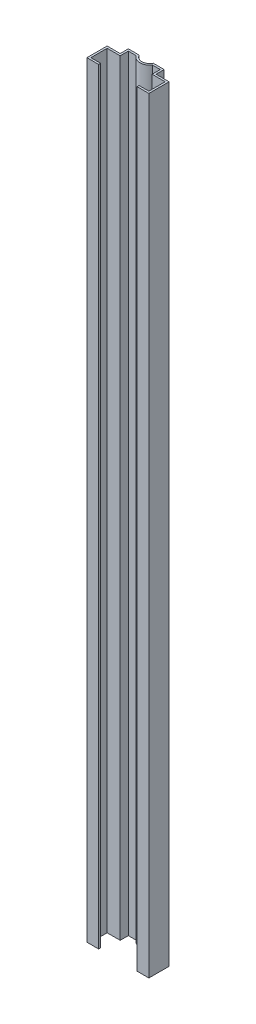
ISO-10303-21;
HEADER;
FILE_DESCRIPTION(('STEP AP214'),'2;1');
FILE_NAME('part.step','',(''),(''),'','','');
FILE_SCHEMA(('AUTOMOTIVE_DESIGN { 1 0 10303 214 1 1 1 1 }'));
ENDSEC;
DATA;
#1=APPLICATION_CONTEXT('core data for automotive mechanical design processes');
#2=APPLICATION_PROTOCOL_DEFINITION('international standard','automotive_design',2000,#1);
#3=PRODUCT_CONTEXT('',#1,'mechanical');
#4=PRODUCT('Part','Part','',(#3));
#5=PRODUCT_RELATED_PRODUCT_CATEGORY('part','',(#4));
#6=PRODUCT_DEFINITION_FORMATION('','',#4);
#7=PRODUCT_DEFINITION_CONTEXT('part definition',#1,'design');
#8=PRODUCT_DEFINITION('design','',#6,#7);
#9=PRODUCT_DEFINITION_SHAPE('','',#8);
#10=(LENGTH_UNIT() NAMED_UNIT(*) SI_UNIT(.MILLI.,.METRE.));
#11=(NAMED_UNIT(*) PLANE_ANGLE_UNIT() SI_UNIT($,.RADIAN.));
#12=(NAMED_UNIT(*) SI_UNIT($,.STERADIAN.) SOLID_ANGLE_UNIT());
#13=UNCERTAINTY_MEASURE_WITH_UNIT(LENGTH_MEASURE(1.E-05),#10,'distance_accuracy_value','');
#14=(GEOMETRIC_REPRESENTATION_CONTEXT(3) GLOBAL_UNCERTAINTY_ASSIGNED_CONTEXT((#13)) GLOBAL_UNIT_ASSIGNED_CONTEXT((#10,
#11,#12)) REPRESENTATION_CONTEXT('',''));
#15=CARTESIAN_POINT('',(0.,0.,0.));
#16=DIRECTION('',(0.,0.,1.));
#17=DIRECTION('',(1.,0.,0.));
#18=AXIS2_PLACEMENT_3D('',#15,#16,#17);
#19=CARTESIAN_POINT('',(0.,4.44089209850063E-13,-91.583123951777));
#20=DIRECTION('',(0.,1.,0.));
#21=DIRECTION('',(0.,0.,1.));
#22=AXIS2_PLACEMENT_3D('',#19,#20,#21);
#23=CYLINDRICAL_SURFACE('',#22,30.);
#24=CARTESIAN_POINT('',(0.,2350.,-91.583123951777));
#25=DIRECTION('',(0.,1.,0.));
#26=DIRECTION('',(0.,0.,1.));
#27=AXIS2_PLACEMENT_3D('',#24,#25,#26);
#28=CIRCLE('',#27,30.);
#29=CARTESIAN_POINT('',(-25.,2350.,-75.));
#30=VERTEX_POINT('',#29);
#31=CARTESIAN_POINT('',(25.,2350.,-75.));
#32=VERTEX_POINT('',#31);
#33=EDGE_CURVE('E226',#30,#32,#28,.T.);
#34=ORIENTED_EDGE('',*,*,#33,.F.);
#35=DIRECTION('',(0.,1.,0.));
#36=VECTOR('',#35,1.);
#37=CARTESIAN_POINT('',(-25.,4.44089209850063E-13,-75.));
#38=LINE('',#37,#36);
#39=CARTESIAN_POINT('',(-25.,4.44089209850063E-13,-75.));
#40=VERTEX_POINT('',#39);
#41=EDGE_CURVE('E11',#40,#30,#38,.T.);
#42=ORIENTED_EDGE('',*,*,#41,.F.);
#43=CARTESIAN_POINT('',(0.,4.44089209850063E-13,-91.583123951777));
#44=DIRECTION('',(0.,1.,0.));
#45=DIRECTION('',(0.,0.,1.));
#46=AXIS2_PLACEMENT_3D('',#43,#44,#45);
#47=CIRCLE('',#46,30.);
#48=CARTESIAN_POINT('',(25.,4.44089209850063E-13,-75.));
#49=VERTEX_POINT('',#48);
#50=EDGE_CURVE('E294',#40,#49,#47,.T.);
#51=ORIENTED_EDGE('',*,*,#50,.T.);
#52=DIRECTION('',(0.,1.,0.));
#53=VECTOR('',#52,1.);
#54=CARTESIAN_POINT('',(25.,4.44089209850063E-13,-75.));
#55=LINE('',#54,#53);
#56=EDGE_CURVE('E36',#49,#32,#55,.T.);
#57=ORIENTED_EDGE('',*,*,#56,.T.);
#58=EDGE_LOOP('',(#34,#42,#51,#57));
#59=FACE_BOUND('',#58,.T.);
#60=ADVANCED_FACE('F33',(#59),#23,.T.);
#61=CARTESIAN_POINT('',(-49.,4.44089209850063E-13,-75.));
#62=DIRECTION('',(0.,0.,1.));
#63=DIRECTION('',(1.,0.,0.));
#64=AXIS2_PLACEMENT_3D('',#61,#62,#63);
#65=PLANE('',#64);
#66=DIRECTION('',(1.,0.,0.));
#67=VECTOR('',#66,1.);
#68=CARTESIAN_POINT('',(-49.,2350.,-75.));
#69=LINE('',#68,#67);
#70=CARTESIAN_POINT('',(-49.,2350.,-75.));
#71=VERTEX_POINT('',#70);
#72=EDGE_CURVE('E292',#71,#30,#69,.T.);
#73=ORIENTED_EDGE('',*,*,#72,.F.);
#74=DIRECTION('',(0.,1.,0.));
#75=VECTOR('',#74,1.);
#76=CARTESIAN_POINT('',(-49.,4.44089209850063E-13,-75.));
#77=LINE('',#76,#75);
#78=CARTESIAN_POINT('',(-49.,4.44089209850063E-13,-75.));
#79=VERTEX_POINT('',#78);
#80=EDGE_CURVE('E42',#79,#71,#77,.T.);
#81=ORIENTED_EDGE('',*,*,#80,.F.);
#82=DIRECTION('',(1.,0.,0.));
#83=VECTOR('',#82,1.);
#84=CARTESIAN_POINT('',(-49.,4.44089209850063E-13,-75.));
#85=LINE('',#84,#83);
#86=EDGE_CURVE('E216',#79,#40,#85,.T.);
#87=ORIENTED_EDGE('',*,*,#86,.T.);
#88=ORIENTED_EDGE('',*,*,#41,.T.);
#89=EDGE_LOOP('',(#73,#81,#87,#88));
#90=FACE_BOUND('',#89,.T.);
#91=ADVANCED_FACE('F338',(#90),#65,.T.);
#92=CARTESIAN_POINT('',(-49.,4.44089209850063E-13,-50.));
#93=DIRECTION('',(1.,0.,0.));
#94=DIRECTION('',(0.,0.,-1.));
#95=AXIS2_PLACEMENT_3D('',#92,#93,#94);
#96=PLANE('',#95);
#97=DIRECTION('',(0.,0.,-1.));
#98=VECTOR('',#97,1.);
#99=CARTESIAN_POINT('',(-49.,2350.,-50.));
#100=LINE('',#99,#98);
#101=CARTESIAN_POINT('',(-49.,2350.,-50.));
#102=VERTEX_POINT('',#101);
#103=EDGE_CURVE('E203',#102,#71,#100,.T.);
#104=ORIENTED_EDGE('',*,*,#103,.F.);
#105=DIRECTION('',(0.,1.,0.));
#106=VECTOR('',#105,1.);
#107=CARTESIAN_POINT('',(-49.,4.44089209850063E-13,-50.));
#108=LINE('',#107,#106);
#109=CARTESIAN_POINT('',(-49.,4.44089209850063E-13,-50.));
#110=VERTEX_POINT('',#109);
#111=EDGE_CURVE('E198',#110,#102,#108,.T.);
#112=ORIENTED_EDGE('',*,*,#111,.F.);
#113=DIRECTION('',(0.,0.,-1.));
#114=VECTOR('',#113,1.);
#115=CARTESIAN_POINT('',(-49.,4.44089209850063E-13,-50.));
#116=LINE('',#115,#114);
#117=EDGE_CURVE('E201',#110,#79,#116,.T.);
#118=ORIENTED_EDGE('',*,*,#117,.T.);
#119=ORIENTED_EDGE('',*,*,#80,.T.);
#120=EDGE_LOOP('',(#104,#112,#118,#119));
#121=FACE_BOUND('',#120,.T.);
#122=ADVANCED_FACE('F200',(#121),#96,.T.);
#123=CARTESIAN_POINT('',(-89.,4.44089209850063E-13,-50.));
#124=DIRECTION('',(0.,0.,1.));
#125=DIRECTION('',(1.,0.,0.));
#126=AXIS2_PLACEMENT_3D('',#123,#124,#125);
#127=PLANE('',#126);
#128=DIRECTION('',(1.,0.,0.));
#129=VECTOR('',#128,1.);
#130=CARTESIAN_POINT('',(-89.,2350.,-50.));
#131=LINE('',#130,#129);
#132=CARTESIAN_POINT('',(-89.,2350.,-50.));
#133=VERTEX_POINT('',#132);
#134=EDGE_CURVE('E289',#133,#102,#131,.T.);
#135=ORIENTED_EDGE('',*,*,#134,.F.);
#136=DIRECTION('',(0.,1.,0.));
#137=VECTOR('',#136,1.);
#138=CARTESIAN_POINT('',(-89.,4.44089209850063E-13,-50.));
#139=LINE('',#138,#137);
#140=CARTESIAN_POINT('',(-89.,4.44089209850063E-13,-50.));
#141=VERTEX_POINT('',#140);
#142=EDGE_CURVE('E208',#141,#133,#139,.T.);
#143=ORIENTED_EDGE('',*,*,#142,.F.);
#144=DIRECTION('',(1.,0.,0.));
#145=VECTOR('',#144,1.);
#146=CARTESIAN_POINT('',(-89.,4.44089209850063E-13,-50.));
#147=LINE('',#146,#145);
#148=EDGE_CURVE('E214',#141,#110,#147,.T.);
#149=ORIENTED_EDGE('',*,*,#148,.T.);
#150=ORIENTED_EDGE('',*,*,#111,.T.);
#151=EDGE_LOOP('',(#135,#143,#149,#150));
#152=FACE_BOUND('',#151,.T.);
#153=ADVANCED_FACE('F218',(#152),#127,.T.);
#154=CARTESIAN_POINT('',(-89.,4.44089209850063E-13,0.));
#155=DIRECTION('',(1.,0.,0.));
#156=DIRECTION('',(0.,0.,-1.));
#157=AXIS2_PLACEMENT_3D('',#154,#155,#156);
#158=PLANE('',#157);
#159=DIRECTION('',(0.,0.,-1.));
#160=VECTOR('',#159,1.);
#161=CARTESIAN_POINT('',(-89.,2350.,0.));
#162=LINE('',#161,#160);
#163=CARTESIAN_POINT('',(-89.,2350.,0.));
#164=VERTEX_POINT('',#163);
#165=EDGE_CURVE('E286',#164,#133,#162,.T.);
#166=ORIENTED_EDGE('',*,*,#165,.F.);
#167=DIRECTION('',(0.,1.,0.));
#168=VECTOR('',#167,1.);
#169=CARTESIAN_POINT('',(-89.,4.44089209850063E-13,0.));
#170=LINE('',#169,#168);
#171=CARTESIAN_POINT('',(-89.,4.44089209850063E-13,0.));
#172=VERTEX_POINT('',#171);
#173=EDGE_CURVE('E298',#172,#164,#170,.T.);
#174=ORIENTED_EDGE('',*,*,#173,.F.);
#175=DIRECTION('',(0.,0.,-1.));
#176=VECTOR('',#175,1.);
#177=CARTESIAN_POINT('',(-89.,4.44089209850063E-13,0.));
#178=LINE('',#177,#176);
#179=EDGE_CURVE('E219',#172,#141,#178,.T.);
#180=ORIENTED_EDGE('',*,*,#179,.T.);
#181=ORIENTED_EDGE('',*,*,#142,.T.);
#182=EDGE_LOOP('',(#166,#174,#180,#181));
#183=FACE_BOUND('',#182,.T.);
#184=ADVANCED_FACE('F351',(#183),#158,.T.);
#185=CARTESIAN_POINT('',(-59.,4.44089209850063E-13,0.));
#186=DIRECTION('',(0.,0.,-1.));
#187=DIRECTION('',(-1.,0.,0.));
#188=AXIS2_PLACEMENT_3D('',#185,#186,#187);
#189=PLANE('',#188);
#190=DIRECTION('',(-1.,0.,0.));
#191=VECTOR('',#190,1.);
#192=CARTESIAN_POINT('',(-59.,2350.,0.));
#193=LINE('',#192,#191);
#194=CARTESIAN_POINT('',(-59.,2350.,0.));
#195=VERTEX_POINT('',#194);
#196=EDGE_CURVE('E283',#195,#164,#193,.T.);
#197=ORIENTED_EDGE('',*,*,#196,.F.);
#198=DIRECTION('',(0.,1.,0.));
#199=VECTOR('',#198,1.);
#200=CARTESIAN_POINT('',(-59.,4.44089209850063E-13,0.));
#201=LINE('',#200,#199);
#202=CARTESIAN_POINT('',(-59.,4.44089209850063E-13,0.));
#203=VERTEX_POINT('',#202);
#204=EDGE_CURVE('E300',#203,#195,#201,.T.);
#205=ORIENTED_EDGE('',*,*,#204,.F.);
#206=DIRECTION('',(-1.,0.,0.));
#207=VECTOR('',#206,1.);
#208=CARTESIAN_POINT('',(-59.,4.44089209850063E-13,0.));
#209=LINE('',#208,#207);
#210=EDGE_CURVE('E221',#203,#172,#209,.T.);
#211=ORIENTED_EDGE('',*,*,#210,.T.);
#212=ORIENTED_EDGE('',*,*,#173,.T.);
#213=EDGE_LOOP('',(#197,#205,#211,#212));
#214=FACE_BOUND('',#213,.T.);
#215=ADVANCED_FACE('F354',(#214),#189,.T.);
#216=CARTESIAN_POINT('',(-59.,4.44089209850063E-13,6.));
#217=DIRECTION('',(1.,0.,0.));
#218=DIRECTION('',(0.,0.,-1.));
#219=AXIS2_PLACEMENT_3D('',#216,#217,#218);
#220=PLANE('',#219);
#221=DIRECTION('',(0.,0.,-1.));
#222=VECTOR('',#221,1.);
#223=CARTESIAN_POINT('',(-59.,2350.,6.));
#224=LINE('',#223,#222);
#225=CARTESIAN_POINT('',(-59.,2350.,6.));
#226=VERTEX_POINT('',#225);
#227=EDGE_CURVE('E280',#226,#195,#224,.T.);
#228=ORIENTED_EDGE('',*,*,#227,.F.);
#229=DIRECTION('',(0.,1.,0.));
#230=VECTOR('',#229,1.);
#231=CARTESIAN_POINT('',(-59.,4.44089209850063E-13,6.));
#232=LINE('',#231,#230);
#233=CARTESIAN_POINT('',(-59.,4.44089209850063E-13,6.));
#234=VERTEX_POINT('',#233);
#235=EDGE_CURVE('E302',#234,#226,#232,.T.);
#236=ORIENTED_EDGE('',*,*,#235,.F.);
#237=DIRECTION('',(0.,0.,-1.));
#238=VECTOR('',#237,1.);
#239=CARTESIAN_POINT('',(-59.,4.44089209850063E-13,6.));
#240=LINE('',#239,#238);
#241=EDGE_CURVE('E644',#234,#203,#240,.T.);
#242=ORIENTED_EDGE('',*,*,#241,.T.);
#243=ORIENTED_EDGE('',*,*,#204,.T.);
#244=EDGE_LOOP('',(#228,#236,#242,#243));
#245=FACE_BOUND('',#244,.T.);
#246=ADVANCED_FACE('F358',(#245),#220,.T.);
#247=CARTESIAN_POINT('',(-95.,4.44089209850063E-13,6.));
#248=DIRECTION('',(0.,0.,1.));
#249=DIRECTION('',(1.,0.,0.));
#250=AXIS2_PLACEMENT_3D('',#247,#248,#249);
#251=PLANE('',#250);
#252=DIRECTION('',(1.,0.,0.));
#253=VECTOR('',#252,1.);
#254=CARTESIAN_POINT('',(-95.,2350.,6.));
#255=LINE('',#254,#253);
#256=CARTESIAN_POINT('',(-95.,2350.,6.));
#257=VERTEX_POINT('',#256);
#258=EDGE_CURVE('E277',#257,#226,#255,.T.);
#259=ORIENTED_EDGE('',*,*,#258,.F.);
#260=DIRECTION('',(0.,1.,0.));
#261=VECTOR('',#260,1.);
#262=CARTESIAN_POINT('',(-95.,4.44089209850063E-13,6.));
#263=LINE('',#262,#261);
#264=CARTESIAN_POINT('',(-95.,4.44089209850063E-13,6.));
#265=VERTEX_POINT('',#264);
#266=EDGE_CURVE('E304',#265,#257,#263,.T.);
#267=ORIENTED_EDGE('',*,*,#266,.F.);
#268=DIRECTION('',(1.,0.,0.));
#269=VECTOR('',#268,1.);
#270=CARTESIAN_POINT('',(-95.,4.44089209850063E-13,6.));
#271=LINE('',#270,#269);
#272=EDGE_CURVE('E648',#265,#234,#271,.T.);
#273=ORIENTED_EDGE('',*,*,#272,.T.);
#274=ORIENTED_EDGE('',*,*,#235,.T.);
#275=EDGE_LOOP('',(#259,#267,#273,#274));
#276=FACE_BOUND('',#275,.T.);
#277=ADVANCED_FACE('F362',(#276),#251,.T.);
#278=CARTESIAN_POINT('',(-95.,4.44089209850063E-13,-56.));
#279=DIRECTION('',(-1.,0.,0.));
#280=DIRECTION('',(0.,0.,1.));
#281=AXIS2_PLACEMENT_3D('',#278,#279,#280);
#282=PLANE('',#281);
#283=DIRECTION('',(0.,0.,1.));
#284=VECTOR('',#283,1.);
#285=CARTESIAN_POINT('',(-95.,2350.,-56.));
#286=LINE('',#285,#284);
#287=CARTESIAN_POINT('',(-95.,2350.,-56.));
#288=VERTEX_POINT('',#287);
#289=EDGE_CURVE('E274',#288,#257,#286,.T.);
#290=ORIENTED_EDGE('',*,*,#289,.F.);
#291=DIRECTION('',(0.,1.,0.));
#292=VECTOR('',#291,1.);
#293=CARTESIAN_POINT('',(-95.,4.44089209850063E-13,-56.));
#294=LINE('',#293,#292);
#295=CARTESIAN_POINT('',(-95.,4.44089209850063E-13,-56.));
#296=VERTEX_POINT('',#295);
#297=EDGE_CURVE('E306',#296,#288,#294,.T.);
#298=ORIENTED_EDGE('',*,*,#297,.F.);
#299=DIRECTION('',(0.,0.,1.));
#300=VECTOR('',#299,1.);
#301=CARTESIAN_POINT('',(-95.,4.44089209850063E-13,-56.));
#302=LINE('',#301,#300);
#303=EDGE_CURVE('E637',#296,#265,#302,.T.);
#304=ORIENTED_EDGE('',*,*,#303,.T.);
#305=ORIENTED_EDGE('',*,*,#266,.T.);
#306=EDGE_LOOP('',(#290,#298,#304,#305));
#307=FACE_BOUND('',#306,.T.);
#308=ADVANCED_FACE('F366',(#307),#282,.T.);
#309=CARTESIAN_POINT('',(-55.,4.44089209850063E-13,-56.));
#310=DIRECTION('',(0.,0.,-1.));
#311=DIRECTION('',(-1.,0.,0.));
#312=AXIS2_PLACEMENT_3D('',#309,#310,#311);
#313=PLANE('',#312);
#314=DIRECTION('',(-1.,0.,0.));
#315=VECTOR('',#314,1.);
#316=CARTESIAN_POINT('',(-55.,2350.,-56.));
#317=LINE('',#316,#315);
#318=CARTESIAN_POINT('',(-55.,2350.,-56.));
#319=VERTEX_POINT('',#318);
#320=EDGE_CURVE('E271',#319,#288,#317,.T.);
#321=ORIENTED_EDGE('',*,*,#320,.F.);
#322=DIRECTION('',(0.,1.,0.));
#323=VECTOR('',#322,1.);
#324=CARTESIAN_POINT('',(-55.,4.44089209850063E-13,-56.));
#325=LINE('',#324,#323);
#326=CARTESIAN_POINT('',(-55.,4.44089209850063E-13,-56.));
#327=VERTEX_POINT('',#326);
#328=EDGE_CURVE('E308',#327,#319,#325,.T.);
#329=ORIENTED_EDGE('',*,*,#328,.F.);
#330=DIRECTION('',(-1.,0.,0.));
#331=VECTOR('',#330,1.);
#332=CARTESIAN_POINT('',(-55.,4.44089209850063E-13,-56.));
#333=LINE('',#332,#331);
#334=EDGE_CURVE('E633',#327,#296,#333,.T.);
#335=ORIENTED_EDGE('',*,*,#334,.T.);
#336=ORIENTED_EDGE('',*,*,#297,.T.);
#337=EDGE_LOOP('',(#321,#329,#335,#336));
#338=FACE_BOUND('',#337,.T.);
#339=ADVANCED_FACE('F370',(#338),#313,.T.);
#340=CARTESIAN_POINT('',(-55.,4.44089209850063E-13,-81.));
#341=DIRECTION('',(-1.,0.,0.));
#342=DIRECTION('',(0.,0.,1.));
#343=AXIS2_PLACEMENT_3D('',#340,#341,#342);
#344=PLANE('',#343);
#345=DIRECTION('',(0.,0.,1.));
#346=VECTOR('',#345,1.);
#347=CARTESIAN_POINT('',(-55.,2350.,-81.));
#348=LINE('',#347,#346);
#349=CARTESIAN_POINT('',(-55.,2350.,-81.));
#350=VERTEX_POINT('',#349);
#351=EDGE_CURVE('E268',#350,#319,#348,.T.);
#352=ORIENTED_EDGE('',*,*,#351,.F.);
#353=DIRECTION('',(0.,1.,0.));
#354=VECTOR('',#353,1.);
#355=CARTESIAN_POINT('',(-55.,4.44089209850063E-13,-81.));
#356=LINE('',#355,#354);
#357=CARTESIAN_POINT('',(-55.,4.44089209850063E-13,-81.));
#358=VERTEX_POINT('',#357);
#359=EDGE_CURVE('E310',#358,#350,#356,.T.);
#360=ORIENTED_EDGE('',*,*,#359,.F.);
#361=DIRECTION('',(0.,0.,1.));
#362=VECTOR('',#361,1.);
#363=CARTESIAN_POINT('',(-55.,4.44089209850063E-13,-81.));
#364=LINE('',#363,#362);
#365=EDGE_CURVE('E654',#358,#327,#364,.T.);
#366=ORIENTED_EDGE('',*,*,#365,.T.);
#367=ORIENTED_EDGE('',*,*,#328,.T.);
#368=EDGE_LOOP('',(#352,#360,#366,#367));
#369=FACE_BOUND('',#368,.T.);
#370=ADVANCED_FACE('F374',(#369),#344,.T.);
#371=CARTESIAN_POINT('',(-21.5406009066907,4.44089209850063E-13,-81.));
#372=DIRECTION('',(0.,0.,-1.));
#373=DIRECTION('',(-1.,0.,0.));
#374=AXIS2_PLACEMENT_3D('',#371,#372,#373);
#375=PLANE('',#374);
#376=DIRECTION('',(-1.,0.,0.));
#377=VECTOR('',#376,1.);
#378=CARTESIAN_POINT('',(-21.5406009066907,2350.,-81.));
#379=LINE('',#378,#377);
#380=CARTESIAN_POINT('',(-21.5406009066907,2350.,-81.));
#381=VERTEX_POINT('',#380);
#382=EDGE_CURVE('E265',#381,#350,#379,.T.);
#383=ORIENTED_EDGE('',*,*,#382,.F.);
#384=DIRECTION('',(0.,1.,0.));
#385=VECTOR('',#384,1.);
#386=CARTESIAN_POINT('',(-21.5406009066907,4.44089209850063E-13,-81.));
#387=LINE('',#386,#385);
#388=CARTESIAN_POINT('',(-21.5406009066907,4.44089209850063E-13,-81.));
#389=VERTEX_POINT('',#388);
#390=EDGE_CURVE('E312',#389,#381,#387,.T.);
#391=ORIENTED_EDGE('',*,*,#390,.F.);
#392=DIRECTION('',(-1.,0.,0.));
#393=VECTOR('',#392,1.);
#394=CARTESIAN_POINT('',(-21.5406009066907,4.44089209850063E-13,-81.));
#395=LINE('',#394,#393);
#396=EDGE_CURVE('E626',#389,#358,#395,.T.);
#397=ORIENTED_EDGE('',*,*,#396,.T.);
#398=ORIENTED_EDGE('',*,*,#359,.T.);
#399=EDGE_LOOP('',(#383,#391,#397,#398));
#400=FACE_BOUND('',#399,.T.);
#401=ADVANCED_FACE('F378',(#400),#375,.T.);
#402=CARTESIAN_POINT('',(0.,4.44089209850063E-13,-91.583123951777));
#403=DIRECTION('',(0.,1.,0.));
#404=DIRECTION('',(0.,0.,1.));
#405=AXIS2_PLACEMENT_3D('',#402,#403,#404);
#406=CYLINDRICAL_SURFACE('',#405,24.);
#407=CARTESIAN_POINT('',(0.,2350.,-91.583123951777));
#408=DIRECTION('',(0.,-1.,0.));
#409=DIRECTION('',(0.,0.,-1.));
#410=AXIS2_PLACEMENT_3D('',#407,#408,#409);
#411=CIRCLE('',#410,24.);
#412=CARTESIAN_POINT('',(21.5406009066907,2350.,-81.));
#413=VERTEX_POINT('',#412);
#414=EDGE_CURVE('E262',#413,#381,#411,.T.);
#415=ORIENTED_EDGE('',*,*,#414,.F.);
#416=DIRECTION('',(0.,1.,0.));
#417=VECTOR('',#416,1.);
#418=CARTESIAN_POINT('',(21.5406009066907,4.44089209850063E-13,-81.));
#419=LINE('',#418,#417);
#420=CARTESIAN_POINT('',(21.5406009066907,4.44089209850063E-13,-81.));
#421=VERTEX_POINT('',#420);
#422=EDGE_CURVE('E314',#421,#413,#419,.T.);
#423=ORIENTED_EDGE('',*,*,#422,.F.);
#424=CARTESIAN_POINT('',(0.,4.44089209850063E-13,-91.583123951777));
#425=DIRECTION('',(0.,-1.,0.));
#426=DIRECTION('',(0.,0.,-1.));
#427=AXIS2_PLACEMENT_3D('',#424,#425,#426);
#428=CIRCLE('',#427,24.);
#429=EDGE_CURVE('E622',#421,#389,#428,.T.);
#430=ORIENTED_EDGE('',*,*,#429,.T.);
#431=ORIENTED_EDGE('',*,*,#390,.T.);
#432=EDGE_LOOP('',(#415,#423,#430,#431));
#433=FACE_BOUND('',#432,.T.);
#434=ADVANCED_FACE('F382',(#433),#406,.F.);
#435=CARTESIAN_POINT('',(55.,4.44089209850063E-13,-81.));
#436=DIRECTION('',(0.,0.,-1.));
#437=DIRECTION('',(-1.,0.,0.));
#438=AXIS2_PLACEMENT_3D('',#435,#436,#437);
#439=PLANE('',#438);
#440=DIRECTION('',(-1.,0.,0.));
#441=VECTOR('',#440,1.);
#442=CARTESIAN_POINT('',(55.,2350.,-81.));
#443=LINE('',#442,#441);
#444=CARTESIAN_POINT('',(55.,2350.,-81.));
#445=VERTEX_POINT('',#444);
#446=EDGE_CURVE('E259',#445,#413,#443,.T.);
#447=ORIENTED_EDGE('',*,*,#446,.F.);
#448=DIRECTION('',(0.,1.,0.));
#449=VECTOR('',#448,1.);
#450=CARTESIAN_POINT('',(55.,4.44089209850063E-13,-81.));
#451=LINE('',#450,#449);
#452=CARTESIAN_POINT('',(55.,4.44089209850063E-13,-81.));
#453=VERTEX_POINT('',#452);
#454=EDGE_CURVE('E316',#453,#445,#451,.T.);
#455=ORIENTED_EDGE('',*,*,#454,.F.);
#456=DIRECTION('',(-1.,0.,0.));
#457=VECTOR('',#456,1.);
#458=CARTESIAN_POINT('',(55.,4.44089209850063E-13,-81.));
#459=LINE('',#458,#457);
#460=EDGE_CURVE('E658',#453,#421,#459,.T.);
#461=ORIENTED_EDGE('',*,*,#460,.T.);
#462=ORIENTED_EDGE('',*,*,#422,.T.);
#463=EDGE_LOOP('',(#447,#455,#461,#462));
#464=FACE_BOUND('',#463,.T.);
#465=ADVANCED_FACE('F386',(#464),#439,.T.);
#466=CARTESIAN_POINT('',(55.,4.44089209850063E-13,-56.));
#467=DIRECTION('',(1.,0.,0.));
#468=DIRECTION('',(0.,0.,-1.));
#469=AXIS2_PLACEMENT_3D('',#466,#467,#468);
#470=PLANE('',#469);
#471=DIRECTION('',(0.,0.,-1.));
#472=VECTOR('',#471,1.);
#473=CARTESIAN_POINT('',(55.,2350.,-56.));
#474=LINE('',#473,#472);
#475=CARTESIAN_POINT('',(55.,2350.,-56.));
#476=VERTEX_POINT('',#475);
#477=EDGE_CURVE('E256',#476,#445,#474,.T.);
#478=ORIENTED_EDGE('',*,*,#477,.F.);
#479=DIRECTION('',(0.,1.,0.));
#480=VECTOR('',#479,1.);
#481=CARTESIAN_POINT('',(55.,4.44089209850063E-13,-56.));
#482=LINE('',#481,#480);
#483=CARTESIAN_POINT('',(55.,4.44089209850063E-13,-56.));
#484=VERTEX_POINT('',#483);
#485=EDGE_CURVE('E318',#484,#476,#482,.T.);
#486=ORIENTED_EDGE('',*,*,#485,.F.);
#487=DIRECTION('',(0.,0.,-1.));
#488=VECTOR('',#487,1.);
#489=CARTESIAN_POINT('',(55.,4.44089209850063E-13,-56.));
#490=LINE('',#489,#488);
#491=EDGE_CURVE('E615',#484,#453,#490,.T.);
#492=ORIENTED_EDGE('',*,*,#491,.T.);
#493=ORIENTED_EDGE('',*,*,#454,.T.);
#494=EDGE_LOOP('',(#478,#486,#492,#493));
#495=FACE_BOUND('',#494,.T.);
#496=ADVANCED_FACE('F390',(#495),#470,.T.);
#497=CARTESIAN_POINT('',(95.,4.44089209850063E-13,-56.));
#498=DIRECTION('',(0.,0.,-1.));
#499=DIRECTION('',(-1.,0.,0.));
#500=AXIS2_PLACEMENT_3D('',#497,#498,#499);
#501=PLANE('',#500);
#502=DIRECTION('',(-1.,0.,0.));
#503=VECTOR('',#502,1.);
#504=CARTESIAN_POINT('',(95.,2350.,-56.));
#505=LINE('',#504,#503);
#506=CARTESIAN_POINT('',(95.,2350.,-56.));
#507=VERTEX_POINT('',#506);
#508=EDGE_CURVE('E253',#507,#476,#505,.T.);
#509=ORIENTED_EDGE('',*,*,#508,.F.);
#510=DIRECTION('',(0.,1.,0.));
#511=VECTOR('',#510,1.);
#512=CARTESIAN_POINT('',(95.,4.44089209850063E-13,-56.));
#513=LINE('',#512,#511);
#514=CARTESIAN_POINT('',(95.,4.44089209850063E-13,-56.));
#515=VERTEX_POINT('',#514);
#516=EDGE_CURVE('E320',#515,#507,#513,.T.);
#517=ORIENTED_EDGE('',*,*,#516,.F.);
#518=DIRECTION('',(-1.,0.,0.));
#519=VECTOR('',#518,1.);
#520=CARTESIAN_POINT('',(95.,4.44089209850063E-13,-56.));
#521=LINE('',#520,#519);
#522=EDGE_CURVE('E611',#515,#484,#521,.T.);
#523=ORIENTED_EDGE('',*,*,#522,.T.);
#524=ORIENTED_EDGE('',*,*,#485,.T.);
#525=EDGE_LOOP('',(#509,#517,#523,#524));
#526=FACE_BOUND('',#525,.T.);
#527=ADVANCED_FACE('F394',(#526),#501,.T.);
#528=CARTESIAN_POINT('',(95.,4.44089209850063E-13,6.));
#529=DIRECTION('',(1.,0.,0.));
#530=DIRECTION('',(0.,0.,-1.));
#531=AXIS2_PLACEMENT_3D('',#528,#529,#530);
#532=PLANE('',#531);
#533=DIRECTION('',(0.,0.,-1.));
#534=VECTOR('',#533,1.);
#535=CARTESIAN_POINT('',(95.,2350.,6.));
#536=LINE('',#535,#534);
#537=CARTESIAN_POINT('',(95.,2350.,6.));
#538=VERTEX_POINT('',#537);
#539=EDGE_CURVE('E250',#538,#507,#536,.T.);
#540=ORIENTED_EDGE('',*,*,#539,.F.);
#541=DIRECTION('',(0.,1.,0.));
#542=VECTOR('',#541,1.);
#543=CARTESIAN_POINT('',(95.,4.44089209850063E-13,6.));
#544=LINE('',#543,#542);
#545=CARTESIAN_POINT('',(95.,4.44089209850063E-13,6.));
#546=VERTEX_POINT('',#545);
#547=EDGE_CURVE('E322',#546,#538,#544,.T.);
#548=ORIENTED_EDGE('',*,*,#547,.F.);
#549=DIRECTION('',(0.,0.,-1.));
#550=VECTOR('',#549,1.);
#551=CARTESIAN_POINT('',(95.,4.44089209850063E-13,6.));
#552=LINE('',#551,#550);
#553=EDGE_CURVE('E662',#546,#515,#552,.T.);
#554=ORIENTED_EDGE('',*,*,#553,.T.);
#555=ORIENTED_EDGE('',*,*,#516,.T.);
#556=EDGE_LOOP('',(#540,#548,#554,#555));
#557=FACE_BOUND('',#556,.T.);
#558=ADVANCED_FACE('F398',(#557),#532,.T.);
#559=CARTESIAN_POINT('',(59.,4.44089209850063E-13,6.));
#560=DIRECTION('',(0.,0.,1.));
#561=DIRECTION('',(1.,0.,0.));
#562=AXIS2_PLACEMENT_3D('',#559,#560,#561);
#563=PLANE('',#562);
#564=DIRECTION('',(1.,0.,0.));
#565=VECTOR('',#564,1.);
#566=CARTESIAN_POINT('',(59.,2350.,6.));
#567=LINE('',#566,#565);
#568=CARTESIAN_POINT('',(59.,2350.,6.));
#569=VERTEX_POINT('',#568);
#570=EDGE_CURVE('E247',#569,#538,#567,.T.);
#571=ORIENTED_EDGE('',*,*,#570,.F.);
#572=DIRECTION('',(0.,1.,0.));
#573=VECTOR('',#572,1.);
#574=CARTESIAN_POINT('',(59.,4.44089209850063E-13,6.));
#575=LINE('',#574,#573);
#576=CARTESIAN_POINT('',(59.,4.44089209850063E-13,6.));
#577=VERTEX_POINT('',#576);
#578=EDGE_CURVE('E324',#577,#569,#575,.T.);
#579=ORIENTED_EDGE('',*,*,#578,.F.);
#580=DIRECTION('',(1.,0.,0.));
#581=VECTOR('',#580,1.);
#582=CARTESIAN_POINT('',(59.,4.44089209850063E-13,6.));
#583=LINE('',#582,#581);
#584=EDGE_CURVE('E604',#577,#546,#583,.T.);
#585=ORIENTED_EDGE('',*,*,#584,.T.);
#586=ORIENTED_EDGE('',*,*,#547,.T.);
#587=EDGE_LOOP('',(#571,#579,#585,#586));
#588=FACE_BOUND('',#587,.T.);
#589=ADVANCED_FACE('F402',(#588),#563,.T.);
#590=CARTESIAN_POINT('',(59.,4.44089209850063E-13,0.));
#591=DIRECTION('',(-1.,0.,0.));
#592=DIRECTION('',(0.,0.,1.));
#593=AXIS2_PLACEMENT_3D('',#590,#591,#592);
#594=PLANE('',#593);
#595=DIRECTION('',(0.,0.,1.));
#596=VECTOR('',#595,1.);
#597=CARTESIAN_POINT('',(59.,2350.,0.));
#598=LINE('',#597,#596);
#599=CARTESIAN_POINT('',(59.,2350.,0.));
#600=VERTEX_POINT('',#599);
#601=EDGE_CURVE('E244',#600,#569,#598,.T.);
#602=ORIENTED_EDGE('',*,*,#601,.F.);
#603=DIRECTION('',(0.,1.,0.));
#604=VECTOR('',#603,1.);
#605=CARTESIAN_POINT('',(59.,4.44089209850063E-13,0.));
#606=LINE('',#605,#604);
#607=CARTESIAN_POINT('',(59.,4.44089209850063E-13,0.));
#608=VERTEX_POINT('',#607);
#609=EDGE_CURVE('E326',#608,#600,#606,.T.);
#610=ORIENTED_EDGE('',*,*,#609,.F.);
#611=DIRECTION('',(0.,0.,1.));
#612=VECTOR('',#611,1.);
#613=CARTESIAN_POINT('',(59.,4.44089209850063E-13,0.));
#614=LINE('',#613,#612);
#615=EDGE_CURVE('E600',#608,#577,#614,.T.);
#616=ORIENTED_EDGE('',*,*,#615,.T.);
#617=ORIENTED_EDGE('',*,*,#578,.T.);
#618=EDGE_LOOP('',(#602,#610,#616,#617));
#619=FACE_BOUND('',#618,.T.);
#620=ADVANCED_FACE('F406',(#619),#594,.T.);
#621=CARTESIAN_POINT('',(89.,4.44089209850063E-13,0.));
#622=DIRECTION('',(0.,0.,-1.));
#623=DIRECTION('',(-1.,0.,0.));
#624=AXIS2_PLACEMENT_3D('',#621,#622,#623);
#625=PLANE('',#624);
#626=DIRECTION('',(-1.,0.,0.));
#627=VECTOR('',#626,1.);
#628=CARTESIAN_POINT('',(89.,2350.,0.));
#629=LINE('',#628,#627);
#630=CARTESIAN_POINT('',(89.,2350.,0.));
#631=VERTEX_POINT('',#630);
#632=EDGE_CURVE('E241',#631,#600,#629,.T.);
#633=ORIENTED_EDGE('',*,*,#632,.F.);
#634=DIRECTION('',(0.,1.,0.));
#635=VECTOR('',#634,1.);
#636=CARTESIAN_POINT('',(89.,4.44089209850063E-13,0.));
#637=LINE('',#636,#635);
#638=CARTESIAN_POINT('',(89.,4.44089209850063E-13,0.));
#639=VERTEX_POINT('',#638);
#640=EDGE_CURVE('E328',#639,#631,#637,.T.);
#641=ORIENTED_EDGE('',*,*,#640,.F.);
#642=DIRECTION('',(-1.,0.,0.));
#643=VECTOR('',#642,1.);
#644=CARTESIAN_POINT('',(89.,4.44089209850063E-13,0.));
#645=LINE('',#644,#643);
#646=EDGE_CURVE('E666',#639,#608,#645,.T.);
#647=ORIENTED_EDGE('',*,*,#646,.T.);
#648=ORIENTED_EDGE('',*,*,#609,.T.);
#649=EDGE_LOOP('',(#633,#641,#647,#648));
#650=FACE_BOUND('',#649,.T.);
#651=ADVANCED_FACE('F410',(#650),#625,.T.);
#652=CARTESIAN_POINT('',(89.,4.44089209850063E-13,-50.));
#653=DIRECTION('',(-1.,0.,0.));
#654=DIRECTION('',(0.,0.,1.));
#655=AXIS2_PLACEMENT_3D('',#652,#653,#654);
#656=PLANE('',#655);
#657=DIRECTION('',(0.,0.,1.));
#658=VECTOR('',#657,1.);
#659=CARTESIAN_POINT('',(89.,2350.,-50.));
#660=LINE('',#659,#658);
#661=CARTESIAN_POINT('',(89.,2350.,-50.));
#662=VERTEX_POINT('',#661);
#663=EDGE_CURVE('E238',#662,#631,#660,.T.);
#664=ORIENTED_EDGE('',*,*,#663,.F.);
#665=DIRECTION('',(0.,1.,0.));
#666=VECTOR('',#665,1.);
#667=CARTESIAN_POINT('',(89.,4.44089209850063E-13,-50.));
#668=LINE('',#667,#666);
#669=CARTESIAN_POINT('',(89.,4.44089209850063E-13,-50.));
#670=VERTEX_POINT('',#669);
#671=EDGE_CURVE('E330',#670,#662,#668,.T.);
#672=ORIENTED_EDGE('',*,*,#671,.F.);
#673=DIRECTION('',(0.,0.,1.));
#674=VECTOR('',#673,1.);
#675=CARTESIAN_POINT('',(89.,4.44089209850063E-13,-50.));
#676=LINE('',#675,#674);
#677=EDGE_CURVE('E593',#670,#639,#676,.T.);
#678=ORIENTED_EDGE('',*,*,#677,.T.);
#679=ORIENTED_EDGE('',*,*,#640,.T.);
#680=EDGE_LOOP('',(#664,#672,#678,#679));
#681=FACE_BOUND('',#680,.T.);
#682=ADVANCED_FACE('F414',(#681),#656,.T.);
#683=CARTESIAN_POINT('',(49.,4.44089209850063E-13,-50.));
#684=DIRECTION('',(0.,0.,1.));
#685=DIRECTION('',(1.,0.,0.));
#686=AXIS2_PLACEMENT_3D('',#683,#684,#685);
#687=PLANE('',#686);
#688=DIRECTION('',(1.,0.,0.));
#689=VECTOR('',#688,1.);
#690=CARTESIAN_POINT('',(49.,2350.,-50.));
#691=LINE('',#690,#689);
#692=CARTESIAN_POINT('',(49.,2350.,-50.));
#693=VERTEX_POINT('',#692);
#694=EDGE_CURVE('E235',#693,#662,#691,.T.);
#695=ORIENTED_EDGE('',*,*,#694,.F.);
#696=DIRECTION('',(0.,1.,0.));
#697=VECTOR('',#696,1.);
#698=CARTESIAN_POINT('',(49.,4.44089209850063E-13,-50.));
#699=LINE('',#698,#697);
#700=CARTESIAN_POINT('',(49.,4.44089209850063E-13,-50.));
#701=VERTEX_POINT('',#700);
#702=EDGE_CURVE('E332',#701,#693,#699,.T.);
#703=ORIENTED_EDGE('',*,*,#702,.F.);
#704=DIRECTION('',(1.,0.,0.));
#705=VECTOR('',#704,1.);
#706=CARTESIAN_POINT('',(49.,4.44089209850063E-13,-50.));
#707=LINE('',#706,#705);
#708=EDGE_CURVE('E589',#701,#670,#707,.T.);
#709=ORIENTED_EDGE('',*,*,#708,.T.);
#710=ORIENTED_EDGE('',*,*,#671,.T.);
#711=EDGE_LOOP('',(#695,#703,#709,#710));
#712=FACE_BOUND('',#711,.T.);
#713=ADVANCED_FACE('F418',(#712),#687,.T.);
#714=CARTESIAN_POINT('',(49.,4.44089209850063E-13,-75.));
#715=DIRECTION('',(-1.,0.,0.));
#716=DIRECTION('',(0.,0.,1.));
#717=AXIS2_PLACEMENT_3D('',#714,#715,#716);
#718=PLANE('',#717);
#719=DIRECTION('',(0.,0.,1.));
#720=VECTOR('',#719,1.);
#721=CARTESIAN_POINT('',(49.,2350.,-75.));
#722=LINE('',#721,#720);
#723=CARTESIAN_POINT('',(49.,2350.,-75.));
#724=VERTEX_POINT('',#723);
#725=EDGE_CURVE('E232',#724,#693,#722,.T.);
#726=ORIENTED_EDGE('',*,*,#725,.F.);
#727=DIRECTION('',(0.,1.,0.));
#728=VECTOR('',#727,1.);
#729=CARTESIAN_POINT('',(49.,4.44089209850063E-13,-75.));
#730=LINE('',#729,#728);
#731=CARTESIAN_POINT('',(49.,4.44089209850063E-13,-75.));
#732=VERTEX_POINT('',#731);
#733=EDGE_CURVE('E333',#732,#724,#730,.T.);
#734=ORIENTED_EDGE('',*,*,#733,.F.);
#735=DIRECTION('',(0.,0.,1.));
#736=VECTOR('',#735,1.);
#737=CARTESIAN_POINT('',(49.,4.44089209850063E-13,-75.));
#738=LINE('',#737,#736);
#739=EDGE_CURVE('E670',#732,#701,#738,.T.);
#740=ORIENTED_EDGE('',*,*,#739,.T.);
#741=ORIENTED_EDGE('',*,*,#702,.T.);
#742=EDGE_LOOP('',(#726,#734,#740,#741));
#743=FACE_BOUND('',#742,.T.);
#744=ADVANCED_FACE('F422',(#743),#718,.T.);
#745=CARTESIAN_POINT('',(25.,4.44089209850063E-13,-75.));
#746=DIRECTION('',(0.,0.,1.));
#747=DIRECTION('',(1.,0.,0.));
#748=AXIS2_PLACEMENT_3D('',#745,#746,#747);
#749=PLANE('',#748);
#750=DIRECTION('',(1.,0.,0.));
#751=VECTOR('',#750,1.);
#752=CARTESIAN_POINT('',(25.,2350.,-75.));
#753=LINE('',#752,#751);
#754=EDGE_CURVE('E229',#32,#724,#753,.T.);
#755=ORIENTED_EDGE('',*,*,#754,.F.);
#756=ORIENTED_EDGE('',*,*,#56,.F.);
#757=DIRECTION('',(1.,0.,0.));
#758=VECTOR('',#757,1.);
#759=CARTESIAN_POINT('',(25.,4.44089209850063E-13,-75.));
#760=LINE('',#759,#758);
#761=EDGE_CURVE('E672',#49,#732,#760,.T.);
#762=ORIENTED_EDGE('',*,*,#761,.T.);
#763=ORIENTED_EDGE('',*,*,#733,.T.);
#764=EDGE_LOOP('',(#755,#756,#762,#763));
#765=FACE_BOUND('',#764,.T.);
#766=ADVANCED_FACE('F335',(#765),#749,.T.);
#767=CARTESIAN_POINT('',(0.,4.44089209850063E-13,-91.583123951777));
#768=DIRECTION('',(0.,1.,0.));
#769=DIRECTION('',(0.,0.,1.));
#770=AXIS2_PLACEMENT_3D('',#767,#768,#769);
#771=PLANE('',#770);
#772=ORIENTED_EDGE('',*,*,#50,.F.);
#773=ORIENTED_EDGE('',*,*,#86,.F.);
#774=ORIENTED_EDGE('',*,*,#117,.F.);
#775=ORIENTED_EDGE('',*,*,#148,.F.);
#776=ORIENTED_EDGE('',*,*,#179,.F.);
#777=ORIENTED_EDGE('',*,*,#210,.F.);
#778=ORIENTED_EDGE('',*,*,#241,.F.);
#779=ORIENTED_EDGE('',*,*,#272,.F.);
#780=ORIENTED_EDGE('',*,*,#303,.F.);
#781=ORIENTED_EDGE('',*,*,#334,.F.);
#782=ORIENTED_EDGE('',*,*,#365,.F.);
#783=ORIENTED_EDGE('',*,*,#396,.F.);
#784=ORIENTED_EDGE('',*,*,#429,.F.);
#785=ORIENTED_EDGE('',*,*,#460,.F.);
#786=ORIENTED_EDGE('',*,*,#491,.F.);
#787=ORIENTED_EDGE('',*,*,#522,.F.);
#788=ORIENTED_EDGE('',*,*,#553,.F.);
#789=ORIENTED_EDGE('',*,*,#584,.F.);
#790=ORIENTED_EDGE('',*,*,#615,.F.);
#791=ORIENTED_EDGE('',*,*,#646,.F.);
#792=ORIENTED_EDGE('',*,*,#677,.F.);
#793=ORIENTED_EDGE('',*,*,#708,.F.);
#794=ORIENTED_EDGE('',*,*,#739,.F.);
#795=ORIENTED_EDGE('',*,*,#761,.F.);
#796=EDGE_LOOP('',(#772,#773,#774,#775,#776,#777,#778,#779,#780,#781,#782,#783,#784,#785,#786,
#787,#788,#789,#790,#791,#792,#793,#794,#795));
#797=FACE_BOUND('',#796,.T.);
#798=ADVANCED_FACE('F212',(#797),#771,.F.);
#799=CARTESIAN_POINT('',(0.,2350.,-91.583123951777));
#800=DIRECTION('',(0.,1.,0.));
#801=DIRECTION('',(0.,0.,1.));
#802=AXIS2_PLACEMENT_3D('',#799,#800,#801);
#803=PLANE('',#802);
#804=ORIENTED_EDGE('',*,*,#33,.T.);
#805=ORIENTED_EDGE('',*,*,#754,.T.);
#806=ORIENTED_EDGE('',*,*,#725,.T.);
#807=ORIENTED_EDGE('',*,*,#694,.T.);
#808=ORIENTED_EDGE('',*,*,#663,.T.);
#809=ORIENTED_EDGE('',*,*,#632,.T.);
#810=ORIENTED_EDGE('',*,*,#601,.T.);
#811=ORIENTED_EDGE('',*,*,#570,.T.);
#812=ORIENTED_EDGE('',*,*,#539,.T.);
#813=ORIENTED_EDGE('',*,*,#508,.T.);
#814=ORIENTED_EDGE('',*,*,#477,.T.);
#815=ORIENTED_EDGE('',*,*,#446,.T.);
#816=ORIENTED_EDGE('',*,*,#414,.T.);
#817=ORIENTED_EDGE('',*,*,#382,.T.);
#818=ORIENTED_EDGE('',*,*,#351,.T.);
#819=ORIENTED_EDGE('',*,*,#320,.T.);
#820=ORIENTED_EDGE('',*,*,#289,.T.);
#821=ORIENTED_EDGE('',*,*,#258,.T.);
#822=ORIENTED_EDGE('',*,*,#227,.T.);
#823=ORIENTED_EDGE('',*,*,#196,.T.);
#824=ORIENTED_EDGE('',*,*,#165,.T.);
#825=ORIENTED_EDGE('',*,*,#134,.T.);
#826=ORIENTED_EDGE('',*,*,#103,.T.);
#827=ORIENTED_EDGE('',*,*,#72,.T.);
#828=EDGE_LOOP('',(#804,#805,#806,#807,#808,#809,#810,#811,#812,#813,#814,#815,#816,#817,#818,
#819,#820,#821,#822,#823,#824,#825,#826,#827));
#829=FACE_BOUND('',#828,.T.);
#830=ADVANCED_FACE('F337',(#829),#803,.T.);
#831=CLOSED_SHELL('',(#60,#91,#122,#153,#184,#215,#246,#277,#308,#339,#370,#401,#434,#465,#496,
#527,#558,#589,#620,#651,#682,#713,#744,#766,#798,#830));
#832=MANIFOLD_SOLID_BREP('B2',#831);
#833=ADVANCED_BREP_SHAPE_REPRESENTATION('',(#18,#832),#14);
#834=SHAPE_DEFINITION_REPRESENTATION(#9,#833);
ENDSEC;
END-ISO-10303-21;
